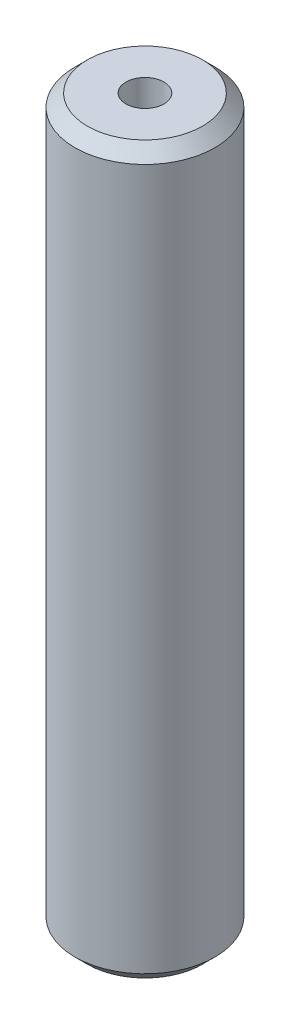
ISO-10303-21;
HEADER;
FILE_DESCRIPTION(('STEP AP214'),'2;1');
FILE_NAME('part.step','',(''),(''),'','','');
FILE_SCHEMA(('AUTOMOTIVE_DESIGN { 1 0 10303 214 1 1 1 1 }'));
ENDSEC;
DATA;
#1=APPLICATION_CONTEXT('core data for automotive mechanical design processes');
#2=APPLICATION_PROTOCOL_DEFINITION('international standard','automotive_design',2000,#1);
#3=PRODUCT_CONTEXT('',#1,'mechanical');
#4=PRODUCT('Part','Part','',(#3));
#5=PRODUCT_RELATED_PRODUCT_CATEGORY('part','',(#4));
#6=PRODUCT_DEFINITION_FORMATION('','',#4);
#7=PRODUCT_DEFINITION_CONTEXT('part definition',#1,'design');
#8=PRODUCT_DEFINITION('design','',#6,#7);
#9=PRODUCT_DEFINITION_SHAPE('','',#8);
#10=(LENGTH_UNIT() NAMED_UNIT(*) SI_UNIT(.MILLI.,.METRE.));
#11=(NAMED_UNIT(*) PLANE_ANGLE_UNIT() SI_UNIT($,.RADIAN.));
#12=(NAMED_UNIT(*) SI_UNIT($,.STERADIAN.) SOLID_ANGLE_UNIT());
#13=UNCERTAINTY_MEASURE_WITH_UNIT(LENGTH_MEASURE(1.E-05),#10,'distance_accuracy_value','');
#14=(GEOMETRIC_REPRESENTATION_CONTEXT(3) GLOBAL_UNCERTAINTY_ASSIGNED_CONTEXT((#13)) GLOBAL_UNIT_ASSIGNED_CONTEXT((#10,
#11,#12)) REPRESENTATION_CONTEXT('',''));
#15=CARTESIAN_POINT('',(0.,0.,0.));
#16=DIRECTION('',(0.,0.,1.));
#17=DIRECTION('',(1.,0.,0.));
#18=AXIS2_PLACEMENT_3D('',#15,#16,#17);
#19=CARTESIAN_POINT('',(0.,103.705596923345,0.));
#20=DIRECTION('',(0.,-1.,0.));
#21=DIRECTION('',(0.,0.,-1.));
#22=AXIS2_PLACEMENT_3D('',#19,#20,#21);
#23=CYLINDRICAL_SURFACE('',#22,10.);
#24=CARTESIAN_POINT('',(0.,101.928343006623,0.));
#25=DIRECTION('',(0.,1.,0.));
#26=DIRECTION('',(0.,0.,1.));
#27=AXIS2_PLACEMENT_3D('',#24,#25,#26);
#28=CIRCLE('',#27,10.);
#29=CARTESIAN_POINT('',(0.,101.928343006623,10.));
#30=VERTEX_POINT('',#29);
#31=EDGE_CURVE('E50',#30,#30,#28,.F.);
#32=ORIENTED_EDGE('',*,*,#31,.T.);
#33=EDGE_LOOP('',(#32));
#34=FACE_BOUND('',#33,.T.);
#35=CARTESIAN_POINT('',(0.,1.77725391672187,0.));
#36=DIRECTION('',(0.,1.,0.));
#37=DIRECTION('',(0.,0.,1.));
#38=AXIS2_PLACEMENT_3D('',#35,#36,#37);
#39=CIRCLE('',#38,10.);
#40=CARTESIAN_POINT('',(0.,1.77725391672187,10.));
#41=VERTEX_POINT('',#40);
#42=EDGE_CURVE('E51',#41,#41,#39,.T.);
#43=ORIENTED_EDGE('',*,*,#42,.T.);
#44=EDGE_LOOP('',(#43));
#45=FACE_BOUND('',#44,.T.);
#46=ADVANCED_FACE('F39',(#34,#45),#23,.T.);
#47=CARTESIAN_POINT('',(0.,103.705596923345,0.));
#48=DIRECTION('',(0.,1.,0.));
#49=DIRECTION('',(0.,0.,1.));
#50=AXIS2_PLACEMENT_3D('',#47,#48,#49);
#51=PLANE('',#50);
#52=CARTESIAN_POINT('',(0.,103.705596923345,0.));
#53=DIRECTION('',(0.,1.,0.));
#54=DIRECTION('',(0.,0.,1.));
#55=AXIS2_PLACEMENT_3D('',#52,#53,#54);
#56=CIRCLE('',#55,8.22274608327814);
#57=CARTESIAN_POINT('',(0.,103.705596923345,8.22274608327814));
#58=VERTEX_POINT('',#57);
#59=EDGE_CURVE('E54',#58,#58,#56,.T.);
#60=ORIENTED_EDGE('',*,*,#59,.T.);
#61=EDGE_LOOP('',(#60));
#62=FACE_BOUND('',#61,.T.);
#63=CARTESIAN_POINT('',(0.,103.705596923345,0.));
#64=DIRECTION('',(0.,1.,0.));
#65=DIRECTION('',(0.,0.,1.));
#66=AXIS2_PLACEMENT_3D('',#63,#64,#65);
#67=CIRCLE('',#66,2.71559090528336);
#68=CARTESIAN_POINT('',(0.,103.705596923345,2.71559090528336));
#69=VERTEX_POINT('',#68);
#70=EDGE_CURVE('E58',#69,#69,#67,.T.);
#71=ORIENTED_EDGE('',*,*,#70,.F.);
#72=EDGE_LOOP('',(#71));
#73=FACE_BOUND('',#72,.T.);
#74=ADVANCED_FACE('F69',(#62,#73),#51,.T.);
#75=CARTESIAN_POINT('',(0.,0.,0.));
#76=DIRECTION('',(0.,1.,0.));
#77=DIRECTION('',(0.,0.,1.));
#78=AXIS2_PLACEMENT_3D('',#75,#76,#77);
#79=PLANE('',#78);
#80=CARTESIAN_POINT('',(0.,0.,0.));
#81=DIRECTION('',(0.,1.,0.));
#82=DIRECTION('',(0.,0.,1.));
#83=AXIS2_PLACEMENT_3D('',#80,#81,#82);
#84=CIRCLE('',#83,8.22274608327811);
#85=CARTESIAN_POINT('',(0.,0.,8.22274608327811));
#86=VERTEX_POINT('',#85);
#87=EDGE_CURVE('E10',#86,#86,#84,.F.);
#88=ORIENTED_EDGE('',*,*,#87,.T.);
#89=EDGE_LOOP('',(#88));
#90=FACE_BOUND('',#89,.T.);
#91=CARTESIAN_POINT('',(0.,0.,0.));
#92=DIRECTION('',(0.,1.,0.));
#93=DIRECTION('',(0.,0.,1.));
#94=AXIS2_PLACEMENT_3D('',#91,#92,#93);
#95=CIRCLE('',#94,2.71559090528336);
#96=CARTESIAN_POINT('',(0.,0.,2.71559090528336));
#97=VERTEX_POINT('',#96);
#98=EDGE_CURVE('E63',#97,#97,#95,.T.);
#99=ORIENTED_EDGE('',*,*,#98,.T.);
#100=EDGE_LOOP('',(#99));
#101=FACE_BOUND('',#100,.T.);
#102=ADVANCED_FACE('F75',(#90,#101),#79,.F.);
#103=CARTESIAN_POINT('',(0.,103.705596923345,0.));
#104=DIRECTION('',(0.,-1.,0.));
#105=DIRECTION('',(0.,0.,-1.));
#106=AXIS2_PLACEMENT_3D('',#103,#104,#105);
#107=CYLINDRICAL_SURFACE('',#106,2.71559090528336);
#108=ORIENTED_EDGE('',*,*,#70,.T.);
#109=EDGE_LOOP('',(#108));
#110=FACE_BOUND('',#109,.T.);
#111=ORIENTED_EDGE('',*,*,#98,.F.);
#112=EDGE_LOOP('',(#111));
#113=FACE_BOUND('',#112,.T.);
#114=ADVANCED_FACE('F70',(#110,#113),#107,.F.);
#115=CARTESIAN_POINT('',(0.,103.705596923345,0.));
#116=DIRECTION('',(0.,-1.,0.));
#117=DIRECTION('',(0.,0.,-1.));
#118=AXIS2_PLACEMENT_3D('',#115,#116,#117);
#119=CONICAL_SURFACE('',#118,8.22274608327814,0.785398163397442);
#120=ORIENTED_EDGE('',*,*,#31,.F.);
#121=EDGE_LOOP('',(#120));
#122=FACE_BOUND('',#121,.T.);
#123=ORIENTED_EDGE('',*,*,#59,.F.);
#124=EDGE_LOOP('',(#123));
#125=FACE_BOUND('',#124,.T.);
#126=ADVANCED_FACE('F81',(#122,#125),#119,.T.);
#127=CARTESIAN_POINT('',(0.,1.77725391672187,0.));
#128=DIRECTION('',(0.,1.,0.));
#129=DIRECTION('',(0.,0.,1.));
#130=AXIS2_PLACEMENT_3D('',#127,#128,#129);
#131=CONICAL_SURFACE('',#130,10.,0.785398163397454);
#132=ORIENTED_EDGE('',*,*,#87,.F.);
#133=EDGE_LOOP('',(#132));
#134=FACE_BOUND('',#133,.T.);
#135=ORIENTED_EDGE('',*,*,#42,.F.);
#136=EDGE_LOOP('',(#135));
#137=FACE_BOUND('',#136,.T.);
#138=ADVANCED_FACE('F45',(#134,#137),#131,.T.);
#139=CLOSED_SHELL('',(#46,#74,#102,#114,#126,#138));
#140=MANIFOLD_SOLID_BREP('B2',#139);
#141=ADVANCED_BREP_SHAPE_REPRESENTATION('',(#18,#140),#14);
#142=SHAPE_DEFINITION_REPRESENTATION(#9,#141);
ENDSEC;
END-ISO-10303-21;
